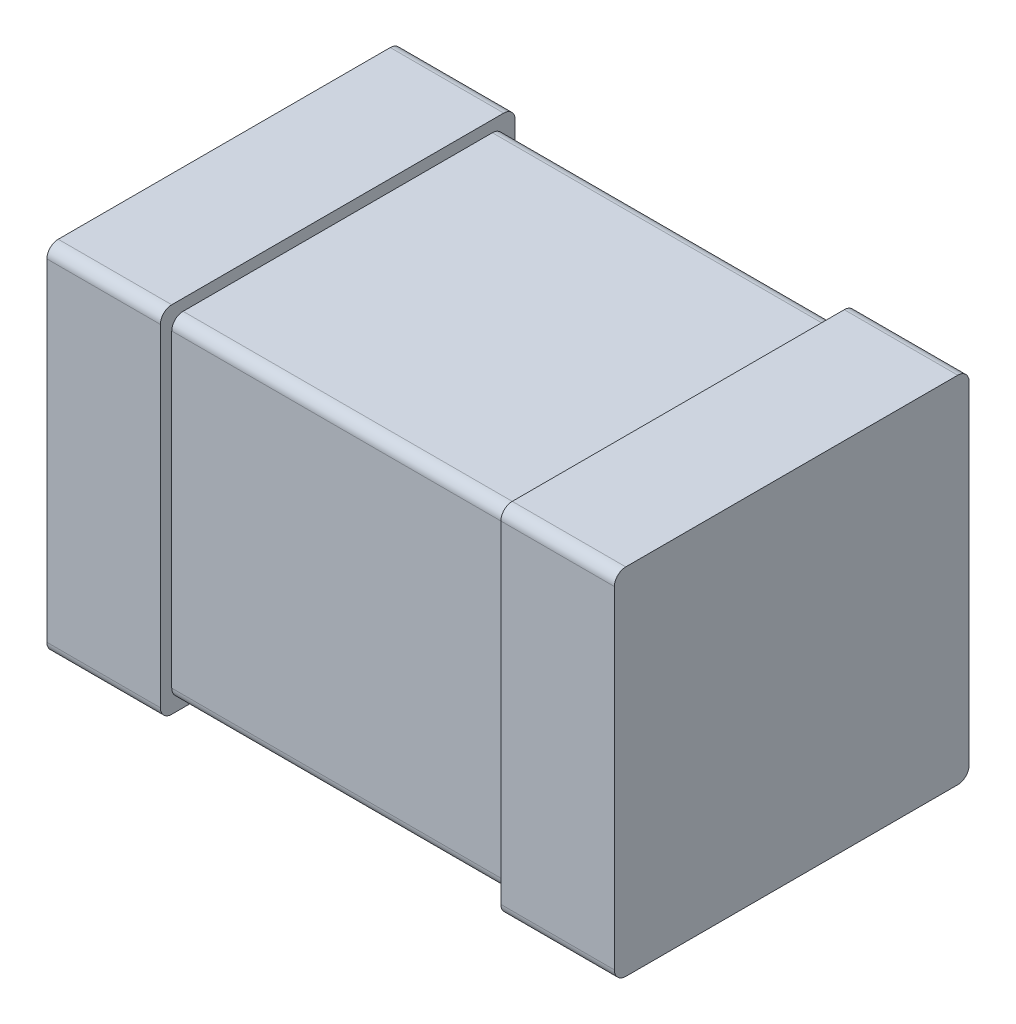
ISO-10303-21;
HEADER;
FILE_DESCRIPTION(('STEP AP214'),'2;1');
FILE_NAME('part.step','',(''),(''),'','','');
FILE_SCHEMA(('AUTOMOTIVE_DESIGN { 1 0 10303 214 1 1 1 1 }'));
ENDSEC;
DATA;
#1=APPLICATION_CONTEXT('core data for automotive mechanical design processes');
#2=APPLICATION_PROTOCOL_DEFINITION('international standard','automotive_design',2000,#1);
#3=PRODUCT_CONTEXT('',#1,'mechanical');
#4=PRODUCT('Part','Part','',(#3));
#5=PRODUCT_RELATED_PRODUCT_CATEGORY('part','',(#4));
#6=PRODUCT_DEFINITION_FORMATION('','',#4);
#7=PRODUCT_DEFINITION_CONTEXT('part definition',#1,'design');
#8=PRODUCT_DEFINITION('design','',#6,#7);
#9=PRODUCT_DEFINITION_SHAPE('','',#8);
#10=(LENGTH_UNIT() NAMED_UNIT(*) SI_UNIT(.MILLI.,.METRE.));
#11=(NAMED_UNIT(*) PLANE_ANGLE_UNIT() SI_UNIT($,.RADIAN.));
#12=(NAMED_UNIT(*) SI_UNIT($,.STERADIAN.) SOLID_ANGLE_UNIT());
#13=UNCERTAINTY_MEASURE_WITH_UNIT(LENGTH_MEASURE(1.E-05),#10,'distance_accuracy_value','');
#14=(GEOMETRIC_REPRESENTATION_CONTEXT(3) GLOBAL_UNCERTAINTY_ASSIGNED_CONTEXT((#13)) GLOBAL_UNIT_ASSIGNED_CONTEXT((#10,
#11,#12)) REPRESENTATION_CONTEXT('',''));
#15=CARTESIAN_POINT('',(0.,0.,0.));
#16=DIRECTION('',(0.,0.,1.));
#17=DIRECTION('',(1.,0.,0.));
#18=AXIS2_PLACEMENT_3D('',#15,#16,#17);
#19=CARTESIAN_POINT('',(-1.,-0.625,0.));
#20=DIRECTION('',(1.,0.,0.));
#21=DIRECTION('',(0.,1.,0.));
#22=AXIS2_PLACEMENT_3D('',#19,#20,#21);
#23=PLANE('',#22);
#24=CARTESIAN_POINT('',(-1.,-0.585,1.21));
#25=DIRECTION('',(-1.,0.,0.));
#26=DIRECTION('',(0.,0.,1.));
#27=AXIS2_PLACEMENT_3D('',#24,#25,#26);
#28=CIRCLE('',#27,0.04);
#29=CARTESIAN_POINT('',(-1.,-0.625,1.21));
#30=VERTEX_POINT('',#29);
#31=CARTESIAN_POINT('',(-1.,-0.585,1.25));
#32=VERTEX_POINT('',#31);
#33=EDGE_CURVE('E11',#30,#32,#28,.T.);
#34=ORIENTED_EDGE('',*,*,#33,.T.);
#35=DIRECTION('',(0.,1.,0.));
#36=VECTOR('',#35,1.);
#37=CARTESIAN_POINT('',(-1.,-0.625,1.25));
#38=LINE('',#37,#36);
#39=CARTESIAN_POINT('',(-1.,0.585,1.25));
#40=VERTEX_POINT('',#39);
#41=EDGE_CURVE('E27',#32,#40,#38,.T.);
#42=ORIENTED_EDGE('',*,*,#41,.T.);
#43=CARTESIAN_POINT('',(-1.,0.585,1.21));
#44=DIRECTION('',(1.,0.,0.));
#45=DIRECTION('',(0.,0.,1.));
#46=AXIS2_PLACEMENT_3D('',#43,#44,#45);
#47=CIRCLE('',#46,0.04);
#48=CARTESIAN_POINT('',(-1.,0.625,1.21));
#49=VERTEX_POINT('',#48);
#50=EDGE_CURVE('E283',#49,#40,#47,.T.);
#51=ORIENTED_EDGE('',*,*,#50,.F.);
#52=DIRECTION('',(0.,0.,1.));
#53=VECTOR('',#52,1.);
#54=CARTESIAN_POINT('',(-1.,0.625,0.));
#55=LINE('',#54,#53);
#56=CARTESIAN_POINT('',(-1.,0.625,0.04));
#57=VERTEX_POINT('',#56);
#58=EDGE_CURVE('E284',#57,#49,#55,.T.);
#59=ORIENTED_EDGE('',*,*,#58,.F.);
#60=CARTESIAN_POINT('',(-1.,0.585,0.04));
#61=DIRECTION('',(-1.,0.,0.));
#62=DIRECTION('',(0.,0.,1.));
#63=AXIS2_PLACEMENT_3D('',#60,#61,#62);
#64=CIRCLE('',#63,0.04);
#65=CARTESIAN_POINT('',(-1.,0.585,0.));
#66=VERTEX_POINT('',#65);
#67=EDGE_CURVE('E279',#57,#66,#64,.T.);
#68=ORIENTED_EDGE('',*,*,#67,.T.);
#69=DIRECTION('',(0.,1.,0.));
#70=VECTOR('',#69,1.);
#71=CARTESIAN_POINT('',(-1.,-0.625,0.));
#72=LINE('',#71,#70);
#73=CARTESIAN_POINT('',(-1.,-0.585,0.));
#74=VERTEX_POINT('',#73);
#75=EDGE_CURVE('E376',#74,#66,#72,.T.);
#76=ORIENTED_EDGE('',*,*,#75,.F.);
#77=CARTESIAN_POINT('',(-1.,-0.585,0.04));
#78=DIRECTION('',(1.,0.,0.));
#79=DIRECTION('',(0.,0.,1.));
#80=AXIS2_PLACEMENT_3D('',#77,#78,#79);
#81=CIRCLE('',#80,0.04);
#82=CARTESIAN_POINT('',(-1.,-0.625,0.04));
#83=VERTEX_POINT('',#82);
#84=EDGE_CURVE('E241',#83,#74,#81,.T.);
#85=ORIENTED_EDGE('',*,*,#84,.F.);
#86=DIRECTION('',(0.,0.,1.));
#87=VECTOR('',#86,1.);
#88=CARTESIAN_POINT('',(-1.,-0.625,0.));
#89=LINE('',#88,#87);
#90=EDGE_CURVE('E291',#83,#30,#89,.T.);
#91=ORIENTED_EDGE('',*,*,#90,.T.);
#92=EDGE_LOOP('',(#34,#42,#51,#59,#68,#76,#85,#91));
#93=FACE_BOUND('',#92,.T.);
#94=ADVANCED_FACE('F16',(#93),#23,.F.);
#95=CARTESIAN_POINT('',(-1.,-0.625,0.));
#96=DIRECTION('',(0.,1.,0.));
#97=DIRECTION('',(1.,0.,0.));
#98=AXIS2_PLACEMENT_3D('',#95,#96,#97);
#99=PLANE('',#98);
#100=DIRECTION('',(1.,0.,0.));
#101=VECTOR('',#100,1.);
#102=CARTESIAN_POINT('',(-1.,-0.625,1.21));
#103=LINE('',#102,#101);
#104=CARTESIAN_POINT('',(-0.6,-0.625,1.21));
#105=VERTEX_POINT('',#104);
#106=EDGE_CURVE('E244',#30,#105,#103,.T.);
#107=ORIENTED_EDGE('',*,*,#106,.F.);
#108=ORIENTED_EDGE('',*,*,#90,.F.);
#109=DIRECTION('',(1.,0.,0.));
#110=VECTOR('',#109,1.);
#111=CARTESIAN_POINT('',(-1.,-0.625,0.04));
#112=LINE('',#111,#110);
#113=CARTESIAN_POINT('',(-0.6,-0.625,0.04));
#114=VERTEX_POINT('',#113);
#115=EDGE_CURVE('E289',#83,#114,#112,.T.);
#116=ORIENTED_EDGE('',*,*,#115,.T.);
#117=DIRECTION('',(0.,0.,1.));
#118=VECTOR('',#117,1.);
#119=CARTESIAN_POINT('',(-0.6,-0.625,0.));
#120=LINE('',#119,#118);
#121=EDGE_CURVE('E230',#114,#105,#120,.T.);
#122=ORIENTED_EDGE('',*,*,#121,.T.);
#123=EDGE_LOOP('',(#107,#108,#116,#122));
#124=FACE_BOUND('',#123,.T.);
#125=ADVANCED_FACE('F576',(#124),#99,.F.);
#126=CARTESIAN_POINT('',(-1.,-0.585,0.04));
#127=DIRECTION('',(1.,0.,0.));
#128=DIRECTION('',(0.,-1.,0.));
#129=AXIS2_PLACEMENT_3D('',#126,#127,#128);
#130=CYLINDRICAL_SURFACE('',#129,0.04);
#131=ORIENTED_EDGE('',*,*,#84,.T.);
#132=DIRECTION('',(1.,0.,0.));
#133=VECTOR('',#132,1.);
#134=CARTESIAN_POINT('',(-1.,-0.585,0.));
#135=LINE('',#134,#133);
#136=CARTESIAN_POINT('',(-0.6,-0.585,0.));
#137=VERTEX_POINT('',#136);
#138=EDGE_CURVE('E239',#74,#137,#135,.T.);
#139=ORIENTED_EDGE('',*,*,#138,.T.);
#140=CARTESIAN_POINT('',(-0.6,-0.585,0.04));
#141=DIRECTION('',(1.,0.,0.));
#142=DIRECTION('',(0.,0.,1.));
#143=AXIS2_PLACEMENT_3D('',#140,#141,#142);
#144=CIRCLE('',#143,0.04);
#145=EDGE_CURVE('E221',#114,#137,#144,.T.);
#146=ORIENTED_EDGE('',*,*,#145,.F.);
#147=ORIENTED_EDGE('',*,*,#115,.F.);
#148=EDGE_LOOP('',(#131,#139,#146,#147));
#149=FACE_BOUND('',#148,.T.);
#150=ADVANCED_FACE('F240',(#149),#130,.T.);
#151=CARTESIAN_POINT('',(-1.,-0.585,1.21));
#152=DIRECTION('',(1.,0.,0.));
#153=DIRECTION('',(0.,-1.,0.));
#154=AXIS2_PLACEMENT_3D('',#151,#152,#153);
#155=CYLINDRICAL_SURFACE('',#154,0.04);
#156=ORIENTED_EDGE('',*,*,#106,.T.);
#157=CARTESIAN_POINT('',(-0.6,-0.585,1.21));
#158=DIRECTION('',(-1.,0.,0.));
#159=DIRECTION('',(0.,0.,1.));
#160=AXIS2_PLACEMENT_3D('',#157,#158,#159);
#161=CIRCLE('',#160,0.04);
#162=CARTESIAN_POINT('',(-0.6,-0.585,1.25));
#163=VERTEX_POINT('',#162);
#164=EDGE_CURVE('E391',#105,#163,#161,.T.);
#165=ORIENTED_EDGE('',*,*,#164,.T.);
#166=DIRECTION('',(1.,0.,0.));
#167=VECTOR('',#166,1.);
#168=CARTESIAN_POINT('',(-1.,-0.585,1.25));
#169=LINE('',#168,#167);
#170=EDGE_CURVE('E329',#32,#163,#169,.T.);
#171=ORIENTED_EDGE('',*,*,#170,.F.);
#172=ORIENTED_EDGE('',*,*,#33,.F.);
#173=EDGE_LOOP('',(#156,#165,#171,#172));
#174=FACE_BOUND('',#173,.T.);
#175=ADVANCED_FACE('F402',(#174),#155,.T.);
#176=CARTESIAN_POINT('',(-1.,-0.625,0.));
#177=DIRECTION('',(0.,0.,1.));
#178=DIRECTION('',(1.,0.,0.));
#179=AXIS2_PLACEMENT_3D('',#176,#177,#178);
#180=PLANE('',#179);
#181=DIRECTION('',(1.,0.,0.));
#182=VECTOR('',#181,1.);
#183=CARTESIAN_POINT('',(-1.,0.585,0.));
#184=LINE('',#183,#182);
#185=CARTESIAN_POINT('',(-0.6,0.585,0.));
#186=VERTEX_POINT('',#185);
#187=EDGE_CURVE('E247',#66,#186,#184,.T.);
#188=ORIENTED_EDGE('',*,*,#187,.T.);
#189=DIRECTION('',(0.,1.,0.));
#190=VECTOR('',#189,1.);
#191=CARTESIAN_POINT('',(-0.6,-0.625,0.));
#192=LINE('',#191,#190);
#193=EDGE_CURVE('E226',#137,#186,#192,.T.);
#194=ORIENTED_EDGE('',*,*,#193,.F.);
#195=ORIENTED_EDGE('',*,*,#138,.F.);
#196=ORIENTED_EDGE('',*,*,#75,.T.);
#197=EDGE_LOOP('',(#188,#194,#195,#196));
#198=FACE_BOUND('',#197,.T.);
#199=ADVANCED_FACE('F245',(#198),#180,.F.);
#200=CARTESIAN_POINT('',(-1.,-0.625,1.25));
#201=DIRECTION('',(0.,0.,1.));
#202=DIRECTION('',(1.,0.,0.));
#203=AXIS2_PLACEMENT_3D('',#200,#201,#202);
#204=PLANE('',#203);
#205=ORIENTED_EDGE('',*,*,#41,.F.);
#206=ORIENTED_EDGE('',*,*,#170,.T.);
#207=DIRECTION('',(0.,1.,0.));
#208=VECTOR('',#207,1.);
#209=CARTESIAN_POINT('',(-0.6,-0.625,1.25));
#210=LINE('',#209,#208);
#211=CARTESIAN_POINT('',(-0.6,0.585,1.25));
#212=VERTEX_POINT('',#211);
#213=EDGE_CURVE('E325',#163,#212,#210,.T.);
#214=ORIENTED_EDGE('',*,*,#213,.T.);
#215=DIRECTION('',(1.,0.,0.));
#216=VECTOR('',#215,1.);
#217=CARTESIAN_POINT('',(-1.,0.585,1.25));
#218=LINE('',#217,#216);
#219=EDGE_CURVE('E280',#40,#212,#218,.T.);
#220=ORIENTED_EDGE('',*,*,#219,.F.);
#221=EDGE_LOOP('',(#205,#206,#214,#220));
#222=FACE_BOUND('',#221,.T.);
#223=ADVANCED_FACE('F18',(#222),#204,.T.);
#224=CARTESIAN_POINT('',(-1.,0.585,0.04));
#225=DIRECTION('',(1.,0.,0.));
#226=DIRECTION('',(0.,1.,0.));
#227=AXIS2_PLACEMENT_3D('',#224,#225,#226);
#228=CYLINDRICAL_SURFACE('',#227,0.04);
#229=DIRECTION('',(1.,0.,0.));
#230=VECTOR('',#229,1.);
#231=CARTESIAN_POINT('',(-1.,0.625,0.04));
#232=LINE('',#231,#230);
#233=CARTESIAN_POINT('',(-0.6,0.625,0.04));
#234=VERTEX_POINT('',#233);
#235=EDGE_CURVE('E288',#57,#234,#232,.T.);
#236=ORIENTED_EDGE('',*,*,#235,.T.);
#237=CARTESIAN_POINT('',(-0.6,0.585,0.04));
#238=DIRECTION('',(-1.,0.,0.));
#239=DIRECTION('',(0.,0.,1.));
#240=AXIS2_PLACEMENT_3D('',#237,#238,#239);
#241=CIRCLE('',#240,0.04);
#242=EDGE_CURVE('E285',#234,#186,#241,.T.);
#243=ORIENTED_EDGE('',*,*,#242,.T.);
#244=ORIENTED_EDGE('',*,*,#187,.F.);
#245=ORIENTED_EDGE('',*,*,#67,.F.);
#246=EDGE_LOOP('',(#236,#243,#244,#245));
#247=FACE_BOUND('',#246,.T.);
#248=ADVANCED_FACE('F543',(#247),#228,.T.);
#249=CARTESIAN_POINT('',(-1.,0.585,1.21));
#250=DIRECTION('',(1.,0.,0.));
#251=DIRECTION('',(0.,1.,0.));
#252=AXIS2_PLACEMENT_3D('',#249,#250,#251);
#253=CYLINDRICAL_SURFACE('',#252,0.04);
#254=ORIENTED_EDGE('',*,*,#50,.T.);
#255=ORIENTED_EDGE('',*,*,#219,.T.);
#256=CARTESIAN_POINT('',(-0.6,0.585,1.21));
#257=DIRECTION('',(1.,0.,0.));
#258=DIRECTION('',(0.,0.,1.));
#259=AXIS2_PLACEMENT_3D('',#256,#257,#258);
#260=CIRCLE('',#259,0.04);
#261=CARTESIAN_POINT('',(-0.6,0.625,1.21));
#262=VERTEX_POINT('',#261);
#263=EDGE_CURVE('E257',#262,#212,#260,.T.);
#264=ORIENTED_EDGE('',*,*,#263,.F.);
#265=DIRECTION('',(1.,0.,0.));
#266=VECTOR('',#265,1.);
#267=CARTESIAN_POINT('',(-1.,0.625,1.21));
#268=LINE('',#267,#266);
#269=EDGE_CURVE('E235',#49,#262,#268,.T.);
#270=ORIENTED_EDGE('',*,*,#269,.F.);
#271=EDGE_LOOP('',(#254,#255,#264,#270));
#272=FACE_BOUND('',#271,.T.);
#273=ADVANCED_FACE('F536',(#272),#253,.T.);
#274=CARTESIAN_POINT('',(-1.,0.625,0.));
#275=DIRECTION('',(0.,1.,0.));
#276=DIRECTION('',(1.,0.,0.));
#277=AXIS2_PLACEMENT_3D('',#274,#275,#276);
#278=PLANE('',#277);
#279=DIRECTION('',(0.,0.,1.));
#280=VECTOR('',#279,1.);
#281=CARTESIAN_POINT('',(-0.6,0.625,0.));
#282=LINE('',#281,#280);
#283=EDGE_CURVE('E250',#234,#262,#282,.T.);
#284=ORIENTED_EDGE('',*,*,#283,.F.);
#285=ORIENTED_EDGE('',*,*,#235,.F.);
#286=ORIENTED_EDGE('',*,*,#58,.T.);
#287=ORIENTED_EDGE('',*,*,#269,.T.);
#288=EDGE_LOOP('',(#284,#285,#286,#287));
#289=FACE_BOUND('',#288,.T.);
#290=ADVANCED_FACE('F542',(#289),#278,.T.);
#291=CARTESIAN_POINT('',(-0.6,-0.625,0.));
#292=DIRECTION('',(1.,0.,0.));
#293=DIRECTION('',(0.,1.,0.));
#294=AXIS2_PLACEMENT_3D('',#291,#292,#293);
#295=PLANE('',#294);
#296=ORIENTED_EDGE('',*,*,#121,.F.);
#297=ORIENTED_EDGE('',*,*,#145,.T.);
#298=ORIENTED_EDGE('',*,*,#193,.T.);
#299=ORIENTED_EDGE('',*,*,#242,.F.);
#300=ORIENTED_EDGE('',*,*,#283,.T.);
#301=ORIENTED_EDGE('',*,*,#263,.T.);
#302=ORIENTED_EDGE('',*,*,#213,.F.);
#303=ORIENTED_EDGE('',*,*,#164,.F.);
#304=EDGE_LOOP('',(#296,#297,#298,#299,#300,#301,#302,#303));
#305=FACE_BOUND('',#304,.T.);
#306=CARTESIAN_POINT('',(-0.6,-0.545,0.08));
#307=DIRECTION('',(1.,0.,0.));
#308=DIRECTION('',(0.,0.,1.));
#309=AXIS2_PLACEMENT_3D('',#306,#307,#308);
#310=CIRCLE('',#309,0.04);
#311=CARTESIAN_POINT('',(-0.6,-0.585,0.08));
#312=VERTEX_POINT('',#311);
#313=CARTESIAN_POINT('',(-0.6,-0.545,0.04));
#314=VERTEX_POINT('',#313);
#315=EDGE_CURVE('E418',#312,#314,#310,.T.);
#316=ORIENTED_EDGE('',*,*,#315,.F.);
#317=DIRECTION('',(0.,0.,1.));
#318=VECTOR('',#317,1.);
#319=CARTESIAN_POINT('',(-0.6,-0.585,0.04));
#320=LINE('',#319,#318);
#321=CARTESIAN_POINT('',(-0.6,-0.585,1.17));
#322=VERTEX_POINT('',#321);
#323=EDGE_CURVE('E408',#312,#322,#320,.T.);
#324=ORIENTED_EDGE('',*,*,#323,.T.);
#325=CARTESIAN_POINT('',(-0.6,-0.545,1.17));
#326=DIRECTION('',(-1.,0.,0.));
#327=DIRECTION('',(0.,0.,1.));
#328=AXIS2_PLACEMENT_3D('',#325,#326,#327);
#329=CIRCLE('',#328,0.04);
#330=CARTESIAN_POINT('',(-0.6,-0.545,1.21));
#331=VERTEX_POINT('',#330);
#332=EDGE_CURVE('E323',#322,#331,#329,.T.);
#333=ORIENTED_EDGE('',*,*,#332,.T.);
#334=DIRECTION('',(0.,1.,0.));
#335=VECTOR('',#334,1.);
#336=CARTESIAN_POINT('',(-0.6,-0.585,1.21));
#337=LINE('',#336,#335);
#338=CARTESIAN_POINT('',(-0.6,0.545,1.21));
#339=VERTEX_POINT('',#338);
#340=EDGE_CURVE('E319',#331,#339,#337,.T.);
#341=ORIENTED_EDGE('',*,*,#340,.T.);
#342=CARTESIAN_POINT('',(-0.6,0.545,1.17));
#343=DIRECTION('',(1.,0.,0.));
#344=DIRECTION('',(0.,0.,1.));
#345=AXIS2_PLACEMENT_3D('',#342,#343,#344);
#346=CIRCLE('',#345,0.04);
#347=CARTESIAN_POINT('',(-0.6,0.585,1.17));
#348=VERTEX_POINT('',#347);
#349=EDGE_CURVE('E263',#348,#339,#346,.T.);
#350=ORIENTED_EDGE('',*,*,#349,.F.);
#351=DIRECTION('',(0.,0.,1.));
#352=VECTOR('',#351,1.);
#353=CARTESIAN_POINT('',(-0.6,0.585,0.04));
#354=LINE('',#353,#352);
#355=CARTESIAN_POINT('',(-0.6,0.585,0.08));
#356=VERTEX_POINT('',#355);
#357=EDGE_CURVE('E333',#356,#348,#354,.T.);
#358=ORIENTED_EDGE('',*,*,#357,.F.);
#359=CARTESIAN_POINT('',(-0.6,0.545,0.08));
#360=DIRECTION('',(-1.,0.,0.));
#361=DIRECTION('',(0.,0.,1.));
#362=AXIS2_PLACEMENT_3D('',#359,#360,#361);
#363=CIRCLE('',#362,0.04);
#364=CARTESIAN_POINT('',(-0.6,0.545,0.04));
#365=VERTEX_POINT('',#364);
#366=EDGE_CURVE('E324',#356,#365,#363,.T.);
#367=ORIENTED_EDGE('',*,*,#366,.T.);
#368=DIRECTION('',(0.,1.,0.));
#369=VECTOR('',#368,1.);
#370=CARTESIAN_POINT('',(-0.6,-0.585,0.04));
#371=LINE('',#370,#369);
#372=EDGE_CURVE('E472',#314,#365,#371,.T.);
#373=ORIENTED_EDGE('',*,*,#372,.F.);
#374=EDGE_LOOP('',(#316,#324,#333,#341,#350,#358,#367,#373));
#375=FACE_BOUND('',#374,.T.);
#376=ADVANCED_FACE('F223',(#305,#375),#295,.T.);
#377=CARTESIAN_POINT('',(-0.6,-0.545,0.08));
#378=DIRECTION('',(1.,0.,0.));
#379=DIRECTION('',(0.,-1.,0.));
#380=AXIS2_PLACEMENT_3D('',#377,#378,#379);
#381=CYLINDRICAL_SURFACE('',#380,0.04);
#382=ORIENTED_EDGE('',*,*,#315,.T.);
#383=DIRECTION('',(1.,0.,0.));
#384=VECTOR('',#383,1.);
#385=CARTESIAN_POINT('',(-0.6,-0.545,0.04));
#386=LINE('',#385,#384);
#387=CARTESIAN_POINT('',(0.6,-0.545,0.04));
#388=VERTEX_POINT('',#387);
#389=EDGE_CURVE('E464',#314,#388,#386,.T.);
#390=ORIENTED_EDGE('',*,*,#389,.T.);
#391=CARTESIAN_POINT('',(0.6,-0.545,0.08));
#392=DIRECTION('',(1.,0.,0.));
#393=DIRECTION('',(0.,0.,1.));
#394=AXIS2_PLACEMENT_3D('',#391,#392,#393);
#395=CIRCLE('',#394,0.04);
#396=CARTESIAN_POINT('',(0.6,-0.585,0.08));
#397=VERTEX_POINT('',#396);
#398=EDGE_CURVE('E351',#397,#388,#395,.T.);
#399=ORIENTED_EDGE('',*,*,#398,.F.);
#400=DIRECTION('',(1.,0.,0.));
#401=VECTOR('',#400,1.);
#402=CARTESIAN_POINT('',(-0.6,-0.585,0.08));
#403=LINE('',#402,#401);
#404=EDGE_CURVE('E385',#312,#397,#403,.T.);
#405=ORIENTED_EDGE('',*,*,#404,.F.);
#406=EDGE_LOOP('',(#382,#390,#399,#405));
#407=FACE_BOUND('',#406,.T.);
#408=ADVANCED_FACE('F525',(#407),#381,.T.);
#409=CARTESIAN_POINT('',(-0.6,-0.585,0.04));
#410=DIRECTION('',(0.,0.,1.));
#411=DIRECTION('',(1.,0.,0.));
#412=AXIS2_PLACEMENT_3D('',#409,#410,#411);
#413=PLANE('',#412);
#414=DIRECTION('',(1.,0.,0.));
#415=VECTOR('',#414,1.);
#416=CARTESIAN_POINT('',(-0.6,0.545,0.04));
#417=LINE('',#416,#415);
#418=CARTESIAN_POINT('',(0.6,0.545,0.04));
#419=VERTEX_POINT('',#418);
#420=EDGE_CURVE('E468',#365,#419,#417,.T.);
#421=ORIENTED_EDGE('',*,*,#420,.T.);
#422=DIRECTION('',(0.,1.,0.));
#423=VECTOR('',#422,1.);
#424=CARTESIAN_POINT('',(0.6,-0.585,0.04));
#425=LINE('',#424,#423);
#426=EDGE_CURVE('E20',#388,#419,#425,.T.);
#427=ORIENTED_EDGE('',*,*,#426,.F.);
#428=ORIENTED_EDGE('',*,*,#389,.F.);
#429=ORIENTED_EDGE('',*,*,#372,.T.);
#430=EDGE_LOOP('',(#421,#427,#428,#429));
#431=FACE_BOUND('',#430,.T.);
#432=ADVANCED_FACE('F529',(#431),#413,.F.);
#433=CARTESIAN_POINT('',(-0.6,0.545,0.08));
#434=DIRECTION('',(1.,0.,0.));
#435=DIRECTION('',(0.,1.,0.));
#436=AXIS2_PLACEMENT_3D('',#433,#434,#435);
#437=CYLINDRICAL_SURFACE('',#436,0.04);
#438=DIRECTION('',(1.,0.,0.));
#439=VECTOR('',#438,1.);
#440=CARTESIAN_POINT('',(-0.6,0.585,0.08));
#441=LINE('',#440,#439);
#442=CARTESIAN_POINT('',(0.6,0.585,0.08));
#443=VERTEX_POINT('',#442);
#444=EDGE_CURVE('E463',#356,#443,#441,.T.);
#445=ORIENTED_EDGE('',*,*,#444,.T.);
#446=CARTESIAN_POINT('',(0.6,0.545,0.08));
#447=DIRECTION('',(-1.,0.,0.));
#448=DIRECTION('',(0.,0.,1.));
#449=AXIS2_PLACEMENT_3D('',#446,#447,#448);
#450=CIRCLE('',#449,0.04);
#451=EDGE_CURVE('E367',#443,#419,#450,.T.);
#452=ORIENTED_EDGE('',*,*,#451,.T.);
#453=ORIENTED_EDGE('',*,*,#420,.F.);
#454=ORIENTED_EDGE('',*,*,#366,.F.);
#455=EDGE_LOOP('',(#445,#452,#453,#454));
#456=FACE_BOUND('',#455,.T.);
#457=ADVANCED_FACE('F702',(#456),#437,.T.);
#458=CARTESIAN_POINT('',(-0.6,0.585,0.04));
#459=DIRECTION('',(0.,1.,0.));
#460=DIRECTION('',(1.,0.,0.));
#461=AXIS2_PLACEMENT_3D('',#458,#459,#460);
#462=PLANE('',#461);
#463=DIRECTION('',(0.,0.,1.));
#464=VECTOR('',#463,1.);
#465=CARTESIAN_POINT('',(0.6,0.585,0.04));
#466=LINE('',#465,#464);
#467=CARTESIAN_POINT('',(0.6,0.585,1.17));
#468=VERTEX_POINT('',#467);
#469=EDGE_CURVE('E350',#443,#468,#466,.T.);
#470=ORIENTED_EDGE('',*,*,#469,.F.);
#471=ORIENTED_EDGE('',*,*,#444,.F.);
#472=ORIENTED_EDGE('',*,*,#357,.T.);
#473=DIRECTION('',(1.,0.,0.));
#474=VECTOR('',#473,1.);
#475=CARTESIAN_POINT('',(-0.6,0.585,1.17));
#476=LINE('',#475,#474);
#477=EDGE_CURVE('E265',#348,#468,#476,.T.);
#478=ORIENTED_EDGE('',*,*,#477,.T.);
#479=EDGE_LOOP('',(#470,#471,#472,#478));
#480=FACE_BOUND('',#479,.T.);
#481=ADVANCED_FACE('F503',(#480),#462,.T.);
#482=CARTESIAN_POINT('',(-0.6,0.545,1.17));
#483=DIRECTION('',(1.,0.,0.));
#484=DIRECTION('',(0.,1.,0.));
#485=AXIS2_PLACEMENT_3D('',#482,#483,#484);
#486=CYLINDRICAL_SURFACE('',#485,0.04);
#487=ORIENTED_EDGE('',*,*,#349,.T.);
#488=DIRECTION('',(1.,0.,0.));
#489=VECTOR('',#488,1.);
#490=CARTESIAN_POINT('',(-0.6,0.545,1.21));
#491=LINE('',#490,#489);
#492=CARTESIAN_POINT('',(0.6,0.545,1.21));
#493=VERTEX_POINT('',#492);
#494=EDGE_CURVE('E266',#339,#493,#491,.T.);
#495=ORIENTED_EDGE('',*,*,#494,.T.);
#496=CARTESIAN_POINT('',(0.6,0.545,1.17));
#497=DIRECTION('',(1.,0.,0.));
#498=DIRECTION('',(0.,0.,1.));
#499=AXIS2_PLACEMENT_3D('',#496,#497,#498);
#500=CIRCLE('',#499,0.04);
#501=EDGE_CURVE('E347',#468,#493,#500,.T.);
#502=ORIENTED_EDGE('',*,*,#501,.F.);
#503=ORIENTED_EDGE('',*,*,#477,.F.);
#504=EDGE_LOOP('',(#487,#495,#502,#503));
#505=FACE_BOUND('',#504,.T.);
#506=ADVANCED_FACE('F497',(#505),#486,.T.);
#507=CARTESIAN_POINT('',(-0.6,-0.585,1.21));
#508=DIRECTION('',(0.,0.,1.));
#509=DIRECTION('',(1.,0.,0.));
#510=AXIS2_PLACEMENT_3D('',#507,#508,#509);
#511=PLANE('',#510);
#512=ORIENTED_EDGE('',*,*,#340,.F.);
#513=DIRECTION('',(1.,0.,0.));
#514=VECTOR('',#513,1.);
#515=CARTESIAN_POINT('',(-0.6,-0.545,1.21));
#516=LINE('',#515,#514);
#517=CARTESIAN_POINT('',(0.6,-0.545,1.21));
#518=VERTEX_POINT('',#517);
#519=EDGE_CURVE('E303',#331,#518,#516,.T.);
#520=ORIENTED_EDGE('',*,*,#519,.T.);
#521=DIRECTION('',(0.,1.,0.));
#522=VECTOR('',#521,1.);
#523=CARTESIAN_POINT('',(0.6,-0.585,1.21));
#524=LINE('',#523,#522);
#525=EDGE_CURVE('E299',#518,#493,#524,.T.);
#526=ORIENTED_EDGE('',*,*,#525,.T.);
#527=ORIENTED_EDGE('',*,*,#494,.F.);
#528=EDGE_LOOP('',(#512,#520,#526,#527));
#529=FACE_BOUND('',#528,.T.);
#530=ADVANCED_FACE('F494',(#529),#511,.T.);
#531=CARTESIAN_POINT('',(-0.6,-0.545,1.17));
#532=DIRECTION('',(1.,0.,0.));
#533=DIRECTION('',(0.,-1.,0.));
#534=AXIS2_PLACEMENT_3D('',#531,#532,#533);
#535=CYLINDRICAL_SURFACE('',#534,0.04);
#536=DIRECTION('',(1.,0.,0.));
#537=VECTOR('',#536,1.);
#538=CARTESIAN_POINT('',(-0.6,-0.585,1.17));
#539=LINE('',#538,#537);
#540=CARTESIAN_POINT('',(0.6,-0.585,1.17));
#541=VERTEX_POINT('',#540);
#542=EDGE_CURVE('E304',#322,#541,#539,.T.);
#543=ORIENTED_EDGE('',*,*,#542,.T.);
#544=CARTESIAN_POINT('',(0.6,-0.545,1.17));
#545=DIRECTION('',(-1.,0.,0.));
#546=DIRECTION('',(0.,0.,1.));
#547=AXIS2_PLACEMENT_3D('',#544,#545,#546);
#548=CIRCLE('',#547,0.04);
#549=EDGE_CURVE('E381',#541,#518,#548,.T.);
#550=ORIENTED_EDGE('',*,*,#549,.T.);
#551=ORIENTED_EDGE('',*,*,#519,.F.);
#552=ORIENTED_EDGE('',*,*,#332,.F.);
#553=EDGE_LOOP('',(#543,#550,#551,#552));
#554=FACE_BOUND('',#553,.T.);
#555=ADVANCED_FACE('F492',(#554),#535,.T.);
#556=CARTESIAN_POINT('',(-0.6,-0.585,0.04));
#557=DIRECTION('',(0.,1.,0.));
#558=DIRECTION('',(1.,0.,0.));
#559=AXIS2_PLACEMENT_3D('',#556,#557,#558);
#560=PLANE('',#559);
#561=ORIENTED_EDGE('',*,*,#542,.F.);
#562=ORIENTED_EDGE('',*,*,#323,.F.);
#563=ORIENTED_EDGE('',*,*,#404,.T.);
#564=DIRECTION('',(0.,0.,1.));
#565=VECTOR('',#564,1.);
#566=CARTESIAN_POINT('',(0.6,-0.585,0.04));
#567=LINE('',#566,#565);
#568=EDGE_CURVE('E297',#397,#541,#567,.T.);
#569=ORIENTED_EDGE('',*,*,#568,.T.);
#570=EDGE_LOOP('',(#561,#562,#563,#569));
#571=FACE_BOUND('',#570,.T.);
#572=ADVANCED_FACE('F551',(#571),#560,.F.);
#573=CARTESIAN_POINT('',(0.6,-0.625,0.));
#574=DIRECTION('',(1.,0.,0.));
#575=DIRECTION('',(0.,1.,0.));
#576=AXIS2_PLACEMENT_3D('',#573,#574,#575);
#577=PLANE('',#576);
#578=CARTESIAN_POINT('',(0.6,-0.585,1.21));
#579=DIRECTION('',(-1.,0.,0.));
#580=DIRECTION('',(0.,0.,1.));
#581=AXIS2_PLACEMENT_3D('',#578,#579,#580);
#582=CIRCLE('',#581,0.04);
#583=CARTESIAN_POINT('',(0.6,-0.625,1.21));
#584=VERTEX_POINT('',#583);
#585=CARTESIAN_POINT('',(0.6,-0.585,1.25));
#586=VERTEX_POINT('',#585);
#587=EDGE_CURVE('E293',#584,#586,#582,.T.);
#588=ORIENTED_EDGE('',*,*,#587,.T.);
#589=DIRECTION('',(0.,1.,0.));
#590=VECTOR('',#589,1.);
#591=CARTESIAN_POINT('',(0.6,-0.625,1.25));
#592=LINE('',#591,#590);
#593=CARTESIAN_POINT('',(0.6,0.585,1.25));
#594=VERTEX_POINT('',#593);
#595=EDGE_CURVE('E298',#586,#594,#592,.T.);
#596=ORIENTED_EDGE('',*,*,#595,.T.);
#597=CARTESIAN_POINT('',(0.6,0.585,1.21));
#598=DIRECTION('',(1.,0.,0.));
#599=DIRECTION('',(0.,0.,1.));
#600=AXIS2_PLACEMENT_3D('',#597,#598,#599);
#601=CIRCLE('',#600,0.04);
#602=CARTESIAN_POINT('',(0.6,0.625,1.21));
#603=VERTEX_POINT('',#602);
#604=EDGE_CURVE('E272',#603,#594,#601,.T.);
#605=ORIENTED_EDGE('',*,*,#604,.F.);
#606=DIRECTION('',(0.,0.,1.));
#607=VECTOR('',#606,1.);
#608=CARTESIAN_POINT('',(0.6,0.625,0.));
#609=LINE('',#608,#607);
#610=CARTESIAN_POINT('',(0.6,0.625,0.04));
#611=VERTEX_POINT('',#610);
#612=EDGE_CURVE('E276',#611,#603,#609,.T.);
#613=ORIENTED_EDGE('',*,*,#612,.F.);
#614=CARTESIAN_POINT('',(0.6,0.585,0.04));
#615=DIRECTION('',(-1.,0.,0.));
#616=DIRECTION('',(0.,0.,1.));
#617=AXIS2_PLACEMENT_3D('',#614,#615,#616);
#618=CIRCLE('',#617,0.04);
#619=CARTESIAN_POINT('',(0.6,0.585,0.));
#620=VERTEX_POINT('',#619);
#621=EDGE_CURVE('E314',#611,#620,#618,.T.);
#622=ORIENTED_EDGE('',*,*,#621,.T.);
#623=DIRECTION('',(0.,1.,0.));
#624=VECTOR('',#623,1.);
#625=CARTESIAN_POINT('',(0.6,-0.625,0.));
#626=LINE('',#625,#624);
#627=CARTESIAN_POINT('',(0.6,-0.585,0.));
#628=VERTEX_POINT('',#627);
#629=EDGE_CURVE('E359',#628,#620,#626,.T.);
#630=ORIENTED_EDGE('',*,*,#629,.F.);
#631=CARTESIAN_POINT('',(0.6,-0.585,0.04));
#632=DIRECTION('',(1.,0.,0.));
#633=DIRECTION('',(0.,0.,1.));
#634=AXIS2_PLACEMENT_3D('',#631,#632,#633);
#635=CIRCLE('',#634,0.04);
#636=CARTESIAN_POINT('',(0.6,-0.625,0.04));
#637=VERTEX_POINT('',#636);
#638=EDGE_CURVE('E305',#637,#628,#635,.T.);
#639=ORIENTED_EDGE('',*,*,#638,.F.);
#640=DIRECTION('',(0.,0.,1.));
#641=VECTOR('',#640,1.);
#642=CARTESIAN_POINT('',(0.6,-0.625,0.));
#643=LINE('',#642,#641);
#644=EDGE_CURVE('E311',#637,#584,#643,.T.);
#645=ORIENTED_EDGE('',*,*,#644,.T.);
#646=EDGE_LOOP('',(#588,#596,#605,#613,#622,#630,#639,#645));
#647=FACE_BOUND('',#646,.T.);
#648=ORIENTED_EDGE('',*,*,#426,.T.);
#649=ORIENTED_EDGE('',*,*,#451,.F.);
#650=ORIENTED_EDGE('',*,*,#469,.T.);
#651=ORIENTED_EDGE('',*,*,#501,.T.);
#652=ORIENTED_EDGE('',*,*,#525,.F.);
#653=ORIENTED_EDGE('',*,*,#549,.F.);
#654=ORIENTED_EDGE('',*,*,#568,.F.);
#655=ORIENTED_EDGE('',*,*,#398,.T.);
#656=EDGE_LOOP('',(#648,#649,#650,#651,#652,#653,#654,#655));
#657=FACE_BOUND('',#656,.T.);
#658=ADVANCED_FACE('F555',(#647,#657),#577,.F.);
#659=CARTESIAN_POINT('',(0.6,-0.625,0.));
#660=DIRECTION('',(0.,1.,0.));
#661=DIRECTION('',(1.,0.,0.));
#662=AXIS2_PLACEMENT_3D('',#659,#660,#661);
#663=PLANE('',#662);
#664=DIRECTION('',(1.,0.,0.));
#665=VECTOR('',#664,1.);
#666=CARTESIAN_POINT('',(0.6,-0.625,1.21));
#667=LINE('',#666,#665);
#668=CARTESIAN_POINT('',(1.,-0.625,1.21));
#669=VERTEX_POINT('',#668);
#670=EDGE_CURVE('E343',#584,#669,#667,.T.);
#671=ORIENTED_EDGE('',*,*,#670,.F.);
#672=ORIENTED_EDGE('',*,*,#644,.F.);
#673=DIRECTION('',(1.,0.,0.));
#674=VECTOR('',#673,1.);
#675=CARTESIAN_POINT('',(0.6,-0.625,0.04));
#676=LINE('',#675,#674);
#677=CARTESIAN_POINT('',(1.,-0.625,0.04));
#678=VERTEX_POINT('',#677);
#679=EDGE_CURVE('E261',#637,#678,#676,.T.);
#680=ORIENTED_EDGE('',*,*,#679,.T.);
#681=DIRECTION('',(0.,0.,1.));
#682=VECTOR('',#681,1.);
#683=CARTESIAN_POINT('',(1.,-0.625,0.));
#684=LINE('',#683,#682);
#685=EDGE_CURVE('E309',#678,#669,#684,.T.);
#686=ORIENTED_EDGE('',*,*,#685,.T.);
#687=EDGE_LOOP('',(#671,#672,#680,#686));
#688=FACE_BOUND('',#687,.T.);
#689=ADVANCED_FACE('F566',(#688),#663,.F.);
#690=CARTESIAN_POINT('',(0.6,-0.585,0.04));
#691=DIRECTION('',(1.,0.,0.));
#692=DIRECTION('',(0.,-1.,0.));
#693=AXIS2_PLACEMENT_3D('',#690,#691,#692);
#694=CYLINDRICAL_SURFACE('',#693,0.04);
#695=ORIENTED_EDGE('',*,*,#638,.T.);
#696=DIRECTION('',(1.,0.,0.));
#697=VECTOR('',#696,1.);
#698=CARTESIAN_POINT('',(0.6,-0.585,0.));
#699=LINE('',#698,#697);
#700=CARTESIAN_POINT('',(1.,-0.585,0.));
#701=VERTEX_POINT('',#700);
#702=EDGE_CURVE('E310',#628,#701,#699,.T.);
#703=ORIENTED_EDGE('',*,*,#702,.T.);
#704=CARTESIAN_POINT('',(1.,-0.585,0.04));
#705=DIRECTION('',(1.,0.,0.));
#706=DIRECTION('',(0.,0.,1.));
#707=AXIS2_PLACEMENT_3D('',#704,#705,#706);
#708=CIRCLE('',#707,0.04);
#709=EDGE_CURVE('E372',#678,#701,#708,.T.);
#710=ORIENTED_EDGE('',*,*,#709,.F.);
#711=ORIENTED_EDGE('',*,*,#679,.F.);
#712=EDGE_LOOP('',(#695,#703,#710,#711));
#713=FACE_BOUND('',#712,.T.);
#714=ADVANCED_FACE('F592',(#713),#694,.T.);
#715=CARTESIAN_POINT('',(0.6,-0.585,1.21));
#716=DIRECTION('',(1.,0.,0.));
#717=DIRECTION('',(0.,-1.,0.));
#718=AXIS2_PLACEMENT_3D('',#715,#716,#717);
#719=CYLINDRICAL_SURFACE('',#718,0.04);
#720=ORIENTED_EDGE('',*,*,#670,.T.);
#721=CARTESIAN_POINT('',(1.,-0.585,1.21));
#722=DIRECTION('',(-1.,0.,0.));
#723=DIRECTION('',(0.,0.,1.));
#724=AXIS2_PLACEMENT_3D('',#721,#722,#723);
#725=CIRCLE('',#724,0.04);
#726=CARTESIAN_POINT('',(1.,-0.585,1.25));
#727=VERTEX_POINT('',#726);
#728=EDGE_CURVE('E346',#669,#727,#725,.T.);
#729=ORIENTED_EDGE('',*,*,#728,.T.);
#730=DIRECTION('',(1.,0.,0.));
#731=VECTOR('',#730,1.);
#732=CARTESIAN_POINT('',(0.6,-0.585,1.25));
#733=LINE('',#732,#731);
#734=EDGE_CURVE('E371',#586,#727,#733,.T.);
#735=ORIENTED_EDGE('',*,*,#734,.F.);
#736=ORIENTED_EDGE('',*,*,#587,.F.);
#737=EDGE_LOOP('',(#720,#729,#735,#736));
#738=FACE_BOUND('',#737,.T.);
#739=ADVANCED_FACE('F596',(#738),#719,.T.);
#740=CARTESIAN_POINT('',(0.6,-0.625,0.));
#741=DIRECTION('',(0.,0.,1.));
#742=DIRECTION('',(1.,0.,0.));
#743=AXIS2_PLACEMENT_3D('',#740,#741,#742);
#744=PLANE('',#743);
#745=DIRECTION('',(1.,0.,0.));
#746=VECTOR('',#745,1.);
#747=CARTESIAN_POINT('',(0.6,0.585,0.));
#748=LINE('',#747,#746);
#749=CARTESIAN_POINT('',(1.,0.585,0.));
#750=VERTEX_POINT('',#749);
#751=EDGE_CURVE('E355',#620,#750,#748,.T.);
#752=ORIENTED_EDGE('',*,*,#751,.T.);
#753=DIRECTION('',(0.,1.,0.));
#754=VECTOR('',#753,1.);
#755=CARTESIAN_POINT('',(1.,-0.625,0.));
#756=LINE('',#755,#754);
#757=EDGE_CURVE('E375',#701,#750,#756,.T.);
#758=ORIENTED_EDGE('',*,*,#757,.F.);
#759=ORIENTED_EDGE('',*,*,#702,.F.);
#760=ORIENTED_EDGE('',*,*,#629,.T.);
#761=EDGE_LOOP('',(#752,#758,#759,#760));
#762=FACE_BOUND('',#761,.T.);
#763=ADVANCED_FACE('F726',(#762),#744,.F.);
#764=CARTESIAN_POINT('',(0.6,-0.625,1.25));
#765=DIRECTION('',(0.,0.,1.));
#766=DIRECTION('',(1.,0.,0.));
#767=AXIS2_PLACEMENT_3D('',#764,#765,#766);
#768=PLANE('',#767);
#769=ORIENTED_EDGE('',*,*,#595,.F.);
#770=ORIENTED_EDGE('',*,*,#734,.T.);
#771=DIRECTION('',(0.,1.,0.));
#772=VECTOR('',#771,1.);
#773=CARTESIAN_POINT('',(1.,-0.625,1.25));
#774=LINE('',#773,#772);
#775=CARTESIAN_POINT('',(1.,0.585,1.25));
#776=VERTEX_POINT('',#775);
#777=EDGE_CURVE('E318',#727,#776,#774,.T.);
#778=ORIENTED_EDGE('',*,*,#777,.T.);
#779=DIRECTION('',(1.,0.,0.));
#780=VECTOR('',#779,1.);
#781=CARTESIAN_POINT('',(0.6,0.585,1.25));
#782=LINE('',#781,#780);
#783=EDGE_CURVE('E273',#594,#776,#782,.T.);
#784=ORIENTED_EDGE('',*,*,#783,.F.);
#785=EDGE_LOOP('',(#769,#770,#778,#784));
#786=FACE_BOUND('',#785,.T.);
#787=ADVANCED_FACE('F721',(#786),#768,.T.);
#788=CARTESIAN_POINT('',(0.6,0.585,0.04));
#789=DIRECTION('',(1.,0.,0.));
#790=DIRECTION('',(0.,1.,0.));
#791=AXIS2_PLACEMENT_3D('',#788,#789,#790);
#792=CYLINDRICAL_SURFACE('',#791,0.04);
#793=DIRECTION('',(1.,0.,0.));
#794=VECTOR('',#793,1.);
#795=CARTESIAN_POINT('',(0.6,0.625,0.04));
#796=LINE('',#795,#794);
#797=CARTESIAN_POINT('',(1.,0.625,0.04));
#798=VERTEX_POINT('',#797);
#799=EDGE_CURVE('E271',#611,#798,#796,.T.);
#800=ORIENTED_EDGE('',*,*,#799,.T.);
#801=CARTESIAN_POINT('',(1.,0.585,0.04));
#802=DIRECTION('',(-1.,0.,0.));
#803=DIRECTION('',(0.,0.,1.));
#804=AXIS2_PLACEMENT_3D('',#801,#802,#803);
#805=CIRCLE('',#804,0.04);
#806=EDGE_CURVE('E267',#798,#750,#805,.T.);
#807=ORIENTED_EDGE('',*,*,#806,.T.);
#808=ORIENTED_EDGE('',*,*,#751,.F.);
#809=ORIENTED_EDGE('',*,*,#621,.F.);
#810=EDGE_LOOP('',(#800,#807,#808,#809));
#811=FACE_BOUND('',#810,.T.);
#812=ADVANCED_FACE('F725',(#811),#792,.T.);
#813=CARTESIAN_POINT('',(0.6,0.585,1.21));
#814=DIRECTION('',(1.,0.,0.));
#815=DIRECTION('',(0.,1.,0.));
#816=AXIS2_PLACEMENT_3D('',#813,#814,#815);
#817=CYLINDRICAL_SURFACE('',#816,0.04);
#818=ORIENTED_EDGE('',*,*,#604,.T.);
#819=ORIENTED_EDGE('',*,*,#783,.T.);
#820=CARTESIAN_POINT('',(1.,0.585,1.21));
#821=DIRECTION('',(1.,0.,0.));
#822=DIRECTION('',(0.,0.,1.));
#823=AXIS2_PLACEMENT_3D('',#820,#821,#822);
#824=CIRCLE('',#823,0.04);
#825=CARTESIAN_POINT('',(1.,0.625,1.21));
#826=VERTEX_POINT('',#825);
#827=EDGE_CURVE('E386',#826,#776,#824,.T.);
#828=ORIENTED_EDGE('',*,*,#827,.F.);
#829=DIRECTION('',(1.,0.,0.));
#830=VECTOR('',#829,1.);
#831=CARTESIAN_POINT('',(0.6,0.625,1.21));
#832=LINE('',#831,#830);
#833=EDGE_CURVE('E342',#603,#826,#832,.T.);
#834=ORIENTED_EDGE('',*,*,#833,.F.);
#835=EDGE_LOOP('',(#818,#819,#828,#834));
#836=FACE_BOUND('',#835,.T.);
#837=ADVANCED_FACE('F633',(#836),#817,.T.);
#838=CARTESIAN_POINT('',(0.6,0.625,0.));
#839=DIRECTION('',(0.,1.,0.));
#840=DIRECTION('',(1.,0.,0.));
#841=AXIS2_PLACEMENT_3D('',#838,#839,#840);
#842=PLANE('',#841);
#843=DIRECTION('',(0.,0.,1.));
#844=VECTOR('',#843,1.);
#845=CARTESIAN_POINT('',(1.,0.625,0.));
#846=LINE('',#845,#844);
#847=EDGE_CURVE('E390',#798,#826,#846,.T.);
#848=ORIENTED_EDGE('',*,*,#847,.F.);
#849=ORIENTED_EDGE('',*,*,#799,.F.);
#850=ORIENTED_EDGE('',*,*,#612,.T.);
#851=ORIENTED_EDGE('',*,*,#833,.T.);
#852=EDGE_LOOP('',(#848,#849,#850,#851));
#853=FACE_BOUND('',#852,.T.);
#854=ADVANCED_FACE('F628',(#853),#842,.T.);
#855=CARTESIAN_POINT('',(1.,-0.625,0.));
#856=DIRECTION('',(1.,0.,0.));
#857=DIRECTION('',(0.,1.,0.));
#858=AXIS2_PLACEMENT_3D('',#855,#856,#857);
#859=PLANE('',#858);
#860=ORIENTED_EDGE('',*,*,#685,.F.);
#861=ORIENTED_EDGE('',*,*,#709,.T.);
#862=ORIENTED_EDGE('',*,*,#757,.T.);
#863=ORIENTED_EDGE('',*,*,#806,.F.);
#864=ORIENTED_EDGE('',*,*,#847,.T.);
#865=ORIENTED_EDGE('',*,*,#827,.T.);
#866=ORIENTED_EDGE('',*,*,#777,.F.);
#867=ORIENTED_EDGE('',*,*,#728,.F.);
#868=EDGE_LOOP('',(#860,#861,#862,#863,#864,#865,#866,#867));
#869=FACE_BOUND('',#868,.T.);
#870=ADVANCED_FACE('F632',(#869),#859,.T.);
#871=CLOSED_SHELL('',(#94,#125,#150,#175,#199,#223,#248,#273,#290,#376,#408,#432,#457,#481,#506,
#530,#555,#572,#658,#689,#714,#739,#763,#787,#812,#837,#854,#870));
#872=MANIFOLD_SOLID_BREP('B1',#871);
#873=ADVANCED_BREP_SHAPE_REPRESENTATION('',(#18,#872),#14);
#874=SHAPE_DEFINITION_REPRESENTATION(#9,#873);
ENDSEC;
END-ISO-10303-21;
